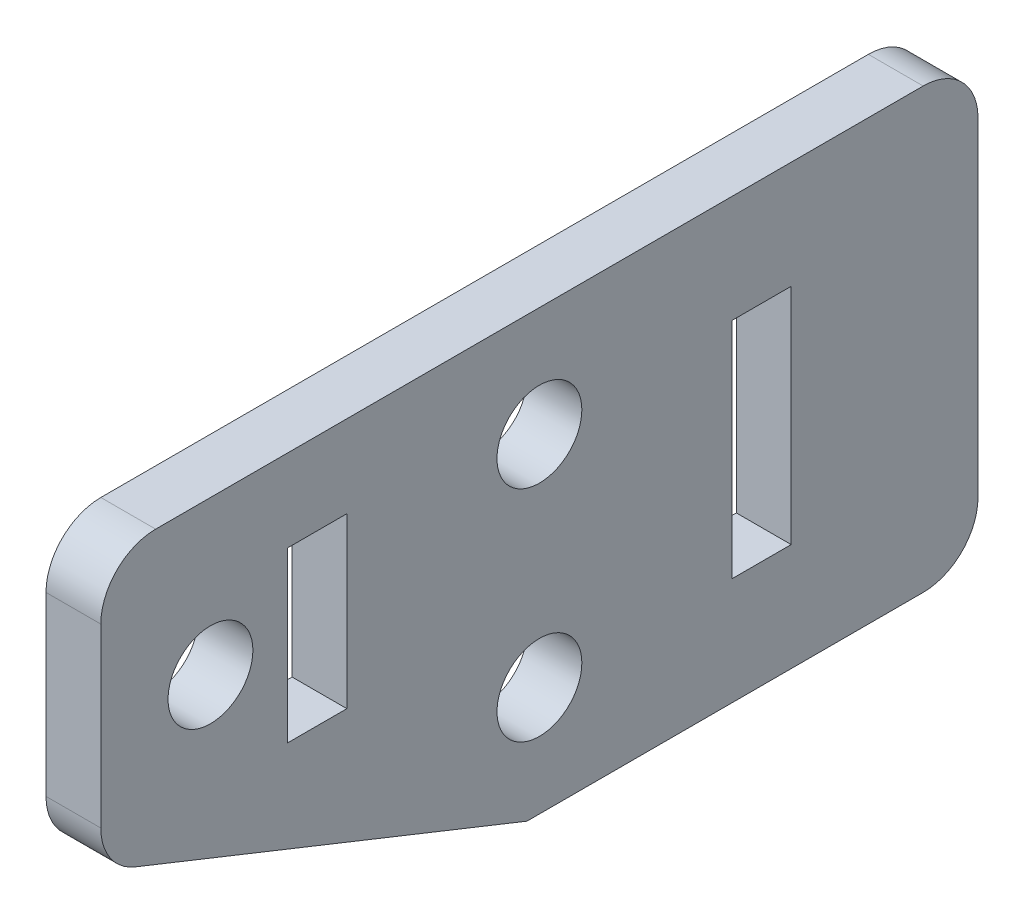
ISO-10303-21;
HEADER;
FILE_DESCRIPTION(('STEP AP214'),'2;1');
FILE_NAME('part.step','',(''),(''),'','','');
FILE_SCHEMA(('AUTOMOTIVE_DESIGN { 1 0 10303 214 1 1 1 1 }'));
ENDSEC;
DATA;
#1=APPLICATION_CONTEXT('core data for automotive mechanical design processes');
#2=APPLICATION_PROTOCOL_DEFINITION('international standard','automotive_design',2000,#1);
#3=PRODUCT_CONTEXT('',#1,'mechanical');
#4=PRODUCT('Part','Part','',(#3));
#5=PRODUCT_RELATED_PRODUCT_CATEGORY('part','',(#4));
#6=PRODUCT_DEFINITION_FORMATION('','',#4);
#7=PRODUCT_DEFINITION_CONTEXT('part definition',#1,'design');
#8=PRODUCT_DEFINITION('design','',#6,#7);
#9=PRODUCT_DEFINITION_SHAPE('','',#8);
#10=(LENGTH_UNIT() NAMED_UNIT(*) SI_UNIT(.MILLI.,.METRE.));
#11=(NAMED_UNIT(*) PLANE_ANGLE_UNIT() SI_UNIT($,.RADIAN.));
#12=(NAMED_UNIT(*) SI_UNIT($,.STERADIAN.) SOLID_ANGLE_UNIT());
#13=UNCERTAINTY_MEASURE_WITH_UNIT(LENGTH_MEASURE(1.E-05),#10,'distance_accuracy_value','');
#14=(GEOMETRIC_REPRESENTATION_CONTEXT(3) GLOBAL_UNCERTAINTY_ASSIGNED_CONTEXT((#13)) GLOBAL_UNIT_ASSIGNED_CONTEXT((#10,
#11,#12)) REPRESENTATION_CONTEXT('',''));
#15=CARTESIAN_POINT('',(0.,0.,0.));
#16=DIRECTION('',(0.,0.,1.));
#17=DIRECTION('',(1.,0.,0.));
#18=AXIS2_PLACEMENT_3D('',#15,#16,#17);
#19=CARTESIAN_POINT('',(3.175,0.,0.));
#20=DIRECTION('',(-1.,0.,0.));
#21=DIRECTION('',(0.,0.,1.));
#22=AXIS2_PLACEMENT_3D('',#19,#20,#21);
#23=PLANE('',#22);
#24=CARTESIAN_POINT('',(3.175,3.81,19.05));
#25=DIRECTION('',(1.,0.,0.));
#26=DIRECTION('',(0.,0.,-1.));
#27=AXIS2_PLACEMENT_3D('',#24,#25,#26);
#28=CIRCLE('',#27,2.45745);
#29=CARTESIAN_POINT('',(3.175,3.81,16.59255));
#30=VERTEX_POINT('',#29);
#31=EDGE_CURVE('E410',#30,#30,#28,.T.);
#32=ORIENTED_EDGE('',*,*,#31,.F.);
#33=EDGE_LOOP('',(#32));
#34=FACE_BOUND('',#33,.T.);
#35=CARTESIAN_POINT('',(3.175,-6.35,0.));
#36=DIRECTION('',(1.,0.,0.));
#37=DIRECTION('',(0.,0.,-1.));
#38=AXIS2_PLACEMENT_3D('',#35,#36,#37);
#39=CIRCLE('',#38,2.45745);
#40=CARTESIAN_POINT('',(3.175,-6.35,-2.45745));
#41=VERTEX_POINT('',#40);
#42=EDGE_CURVE('E412',#41,#41,#39,.T.);
#43=ORIENTED_EDGE('',*,*,#42,.F.);
#44=EDGE_LOOP('',(#43));
#45=FACE_BOUND('',#44,.T.);
#46=DIRECTION('',(0.,0.,-1.));
#47=VECTOR('',#46,1.);
#48=CARTESIAN_POINT('',(3.175,-1.8415,14.5796));
#49=LINE('',#48,#47);
#50=CARTESIAN_POINT('',(3.175,-1.8415,14.5796));
#51=VERTEX_POINT('',#50);
#52=CARTESIAN_POINT('',(3.175,-1.8415,11.1506));
#53=VERTEX_POINT('',#52);
#54=EDGE_CURVE('E185',#51,#53,#49,.T.);
#55=ORIENTED_EDGE('',*,*,#54,.F.);
#56=DIRECTION('',(0.,-1.,0.));
#57=VECTOR('',#56,1.);
#58=CARTESIAN_POINT('',(3.175,-1.8415,14.5796));
#59=LINE('',#58,#57);
#60=CARTESIAN_POINT('',(3.175,7.9375,14.5796));
#61=VERTEX_POINT('',#60);
#62=EDGE_CURVE('E49',#61,#51,#59,.T.);
#63=ORIENTED_EDGE('',*,*,#62,.F.);
#64=DIRECTION('',(0.,0.,1.));
#65=VECTOR('',#64,1.);
#66=CARTESIAN_POINT('',(3.175,7.9375,14.5796));
#67=LINE('',#66,#65);
#68=CARTESIAN_POINT('',(3.175,7.9375,11.1506));
#69=VERTEX_POINT('',#68);
#70=EDGE_CURVE('E173',#69,#61,#67,.T.);
#71=ORIENTED_EDGE('',*,*,#70,.F.);
#72=DIRECTION('',(0.,1.,0.));
#73=VECTOR('',#72,1.);
#74=CARTESIAN_POINT('',(3.175,-1.8415,11.1506));
#75=LINE('',#74,#73);
#76=EDGE_CURVE('E176',#53,#69,#75,.T.);
#77=ORIENTED_EDGE('',*,*,#76,.F.);
#78=EDGE_LOOP('',(#55,#63,#71,#77));
#79=FACE_BOUND('',#78,.T.);
#80=DIRECTION('',(0.,0.,-1.));
#81=VECTOR('',#80,1.);
#82=CARTESIAN_POINT('',(3.175,-6.477,-11.1506));
#83=LINE('',#82,#81);
#84=CARTESIAN_POINT('',(3.175,-6.477,-11.1506));
#85=VERTEX_POINT('',#84);
#86=CARTESIAN_POINT('',(3.175,-6.477,-14.5796));
#87=VERTEX_POINT('',#86);
#88=EDGE_CURVE('E211',#85,#87,#83,.T.);
#89=ORIENTED_EDGE('',*,*,#88,.F.);
#90=DIRECTION('',(0.,-1.,0.));
#91=VECTOR('',#90,1.);
#92=CARTESIAN_POINT('',(3.175,-6.477,-11.1506));
#93=LINE('',#92,#91);
#94=CARTESIAN_POINT('',(3.175,6.477,-11.1506));
#95=VERTEX_POINT('',#94);
#96=EDGE_CURVE('E57',#95,#85,#93,.T.);
#97=ORIENTED_EDGE('',*,*,#96,.F.);
#98=DIRECTION('',(0.,0.,1.));
#99=VECTOR('',#98,1.);
#100=CARTESIAN_POINT('',(3.175,6.477,-11.1506));
#101=LINE('',#100,#99);
#102=CARTESIAN_POINT('',(3.175,6.477,-14.5796));
#103=VERTEX_POINT('',#102);
#104=EDGE_CURVE('E200',#103,#95,#101,.T.);
#105=ORIENTED_EDGE('',*,*,#104,.F.);
#106=DIRECTION('',(0.,1.,0.));
#107=VECTOR('',#106,1.);
#108=CARTESIAN_POINT('',(3.175,-6.477,-14.5796));
#109=LINE('',#108,#107);
#110=EDGE_CURVE('E214',#87,#103,#109,.T.);
#111=ORIENTED_EDGE('',*,*,#110,.F.);
#112=EDGE_LOOP('',(#89,#97,#105,#111));
#113=FACE_BOUND('',#112,.T.);
#114=DIRECTION('',(0.,0.,-1.));
#115=VECTOR('',#114,1.);
#116=CARTESIAN_POINT('',(3.175,-12.7,25.4));
#117=LINE('',#116,#115);
#118=CARTESIAN_POINT('',(3.175,-12.7,0.719569845181661));
#119=VERTEX_POINT('',#118);
#120=CARTESIAN_POINT('',(3.175,-12.7,-22.225));
#121=VERTEX_POINT('',#120);
#122=EDGE_CURVE('E234',#119,#121,#117,.T.);
#123=ORIENTED_EDGE('',*,*,#122,.T.);
#124=CARTESIAN_POINT('',(3.175,-9.525,-22.225));
#125=DIRECTION('',(-1.,0.,0.));
#126=DIRECTION('',(0.,0.,1.));
#127=AXIS2_PLACEMENT_3D('',#124,#125,#126);
#128=CIRCLE('',#127,3.175);
#129=CARTESIAN_POINT('',(3.175,-9.525,-25.4));
#130=VERTEX_POINT('',#129);
#131=EDGE_CURVE('E277',#121,#130,#128,.F.);
#132=ORIENTED_EDGE('',*,*,#131,.T.);
#133=DIRECTION('',(0.,1.,0.));
#134=VECTOR('',#133,1.);
#135=CARTESIAN_POINT('',(3.175,-12.7,-25.4));
#136=LINE('',#135,#134);
#137=CARTESIAN_POINT('',(3.175,9.525,-25.4));
#138=VERTEX_POINT('',#137);
#139=EDGE_CURVE('E238',#130,#138,#136,.T.);
#140=ORIENTED_EDGE('',*,*,#139,.T.);
#141=CARTESIAN_POINT('',(3.175,9.525,-22.225));
#142=DIRECTION('',(-1.,0.,0.));
#143=DIRECTION('',(0.,0.,1.));
#144=AXIS2_PLACEMENT_3D('',#141,#142,#143);
#145=CIRCLE('',#144,3.175);
#146=CARTESIAN_POINT('',(3.175,12.7,-22.225));
#147=VERTEX_POINT('',#146);
#148=EDGE_CURVE('E275',#138,#147,#145,.F.);
#149=ORIENTED_EDGE('',*,*,#148,.T.);
#150=DIRECTION('',(0.,0.,1.));
#151=VECTOR('',#150,1.);
#152=CARTESIAN_POINT('',(3.175,12.7,25.4));
#153=LINE('',#152,#151);
#154=CARTESIAN_POINT('',(3.175,12.7,22.225));
#155=VERTEX_POINT('',#154);
#156=EDGE_CURVE('E241',#147,#155,#153,.T.);
#157=ORIENTED_EDGE('',*,*,#156,.T.);
#158=CARTESIAN_POINT('',(3.175,9.525,22.225));
#159=DIRECTION('',(-1.,0.,0.));
#160=DIRECTION('',(0.,0.,1.));
#161=AXIS2_PLACEMENT_3D('',#158,#159,#160);
#162=CIRCLE('',#161,3.175);
#163=CARTESIAN_POINT('',(3.175,9.525,25.4));
#164=VERTEX_POINT('',#163);
#165=EDGE_CURVE('E273',#155,#164,#162,.F.);
#166=ORIENTED_EDGE('',*,*,#165,.T.);
#167=DIRECTION('',(0.,-1.,0.));
#168=VECTOR('',#167,1.);
#169=CARTESIAN_POINT('',(3.175,-12.7,25.4));
#170=LINE('',#169,#168);
#171=CARTESIAN_POINT('',(3.175,-0.703717106092546,25.4));
#172=VERTEX_POINT('',#171);
#173=EDGE_CURVE('E231',#164,#172,#170,.T.);
#174=ORIENTED_EDGE('',*,*,#173,.T.);
#175=CARTESIAN_POINT('',(3.175,-0.703717106092546,22.225));
#176=DIRECTION('',(-1.,0.,0.));
#177=DIRECTION('',(0.,0.,1.));
#178=AXIS2_PLACEMENT_3D('',#175,#176,#177);
#179=CIRCLE('',#178,3.175);
#180=CARTESIAN_POINT('',(3.175,-3.65277101708831,23.4013103459719));
#181=VERTEX_POINT('',#180);
#182=EDGE_CURVE('E271',#172,#181,#179,.F.);
#183=ORIENTED_EDGE('',*,*,#182,.T.);
#184=DIRECTION('',(0.,0.370491447550212,0.928835877478981));
#185=VECTOR('',#184,1.);
#186=CARTESIAN_POINT('',(3.175,-4.05065103295691,22.4038103061888));
#187=LINE('',#186,#185);
#188=EDGE_CURVE('E192',#119,#181,#187,.T.);
#189=ORIENTED_EDGE('',*,*,#188,.F.);
#190=EDGE_LOOP('',(#123,#132,#140,#149,#157,#166,#174,#183,#189));
#191=FACE_BOUND('',#190,.T.);
#192=CARTESIAN_POINT('',(3.175,6.35,0.));
#193=DIRECTION('',(1.,0.,0.));
#194=DIRECTION('',(0.,0.,-1.));
#195=AXIS2_PLACEMENT_3D('',#192,#193,#194);
#196=CIRCLE('',#195,2.45745);
#197=CARTESIAN_POINT('',(3.175,6.35,-2.45745));
#198=VERTEX_POINT('',#197);
#199=EDGE_CURVE('E419',#198,#198,#196,.T.);
#200=ORIENTED_EDGE('',*,*,#199,.F.);
#201=EDGE_LOOP('',(#200));
#202=FACE_BOUND('',#201,.T.);
#203=ADVANCED_FACE('F34',(#34,#45,#79,#113,#191,#202),#23,.F.);
#204=CARTESIAN_POINT('',(0.,0.,0.));
#205=DIRECTION('',(-1.,0.,0.));
#206=DIRECTION('',(0.,0.,1.));
#207=AXIS2_PLACEMENT_3D('',#204,#205,#206);
#208=PLANE('',#207);
#209=CARTESIAN_POINT('',(0.,3.81,19.05));
#210=DIRECTION('',(1.,0.,0.));
#211=DIRECTION('',(0.,0.,-1.));
#212=AXIS2_PLACEMENT_3D('',#209,#210,#211);
#213=CIRCLE('',#212,2.45745);
#214=CARTESIAN_POINT('',(0.,3.81,16.59255));
#215=VERTEX_POINT('',#214);
#216=EDGE_CURVE('E408',#215,#215,#213,.T.);
#217=ORIENTED_EDGE('',*,*,#216,.T.);
#218=EDGE_LOOP('',(#217));
#219=FACE_BOUND('',#218,.T.);
#220=CARTESIAN_POINT('',(0.,-6.35,0.));
#221=DIRECTION('',(1.,0.,0.));
#222=DIRECTION('',(0.,0.,-1.));
#223=AXIS2_PLACEMENT_3D('',#220,#221,#222);
#224=CIRCLE('',#223,2.45745);
#225=CARTESIAN_POINT('',(0.,-6.35,-2.45745));
#226=VERTEX_POINT('',#225);
#227=EDGE_CURVE('E417',#226,#226,#224,.T.);
#228=ORIENTED_EDGE('',*,*,#227,.T.);
#229=EDGE_LOOP('',(#228));
#230=FACE_BOUND('',#229,.T.);
#231=DIRECTION('',(0.,1.,0.));
#232=VECTOR('',#231,1.);
#233=CARTESIAN_POINT('',(0.,-12.7,-25.4));
#234=LINE('',#233,#232);
#235=CARTESIAN_POINT('',(0.,-9.525,-25.4));
#236=VERTEX_POINT('',#235);
#237=CARTESIAN_POINT('',(0.,9.525,-25.4));
#238=VERTEX_POINT('',#237);
#239=EDGE_CURVE('E250',#236,#238,#234,.T.);
#240=ORIENTED_EDGE('',*,*,#239,.F.);
#241=CARTESIAN_POINT('',(0.,-9.525,-22.225));
#242=DIRECTION('',(-1.,0.,0.));
#243=DIRECTION('',(0.,0.,1.));
#244=AXIS2_PLACEMENT_3D('',#241,#242,#243);
#245=CIRCLE('',#244,3.175);
#246=CARTESIAN_POINT('',(0.,-12.7,-22.225));
#247=VERTEX_POINT('',#246);
#248=EDGE_CURVE('E267',#236,#247,#245,.T.);
#249=ORIENTED_EDGE('',*,*,#248,.T.);
#250=DIRECTION('',(0.,0.,-1.));
#251=VECTOR('',#250,1.);
#252=CARTESIAN_POINT('',(0.,-12.7,25.4));
#253=LINE('',#252,#251);
#254=CARTESIAN_POINT('',(0.,-12.7000000000009,0.719569845182034));
#255=VERTEX_POINT('',#254);
#256=EDGE_CURVE('E247',#255,#247,#253,.T.);
#257=ORIENTED_EDGE('',*,*,#256,.F.);
#258=DIRECTION('',(0.,-0.370491447550212,-0.928835877478981));
#259=VECTOR('',#258,1.);
#260=CARTESIAN_POINT('',(0.,-11.2043708203856,4.46916798196995));
#261=LINE('',#260,#259);
#262=CARTESIAN_POINT('',(0.,-3.65277101708831,23.4013103459719));
#263=VERTEX_POINT('',#262);
#264=EDGE_CURVE('E244',#263,#255,#261,.T.);
#265=ORIENTED_EDGE('',*,*,#264,.F.);
#266=CARTESIAN_POINT('',(0.,-0.703717106092546,22.225));
#267=DIRECTION('',(-1.,0.,0.));
#268=DIRECTION('',(0.,0.,1.));
#269=AXIS2_PLACEMENT_3D('',#266,#267,#268);
#270=CIRCLE('',#269,3.175);
#271=CARTESIAN_POINT('',(0.,-0.703717106092546,25.4));
#272=VERTEX_POINT('',#271);
#273=EDGE_CURVE('E261',#263,#272,#270,.T.);
#274=ORIENTED_EDGE('',*,*,#273,.T.);
#275=DIRECTION('',(0.,-1.,0.));
#276=VECTOR('',#275,1.);
#277=CARTESIAN_POINT('',(0.,-12.7,25.4));
#278=LINE('',#277,#276);
#279=CARTESIAN_POINT('',(0.,9.525,25.4));
#280=VERTEX_POINT('',#279);
#281=EDGE_CURVE('E230',#280,#272,#278,.T.);
#282=ORIENTED_EDGE('',*,*,#281,.F.);
#283=CARTESIAN_POINT('',(0.,9.525,22.225));
#284=DIRECTION('',(-1.,0.,0.));
#285=DIRECTION('',(0.,0.,1.));
#286=AXIS2_PLACEMENT_3D('',#283,#284,#285);
#287=CIRCLE('',#286,3.175);
#288=CARTESIAN_POINT('',(0.,12.7,22.225));
#289=VERTEX_POINT('',#288);
#290=EDGE_CURVE('E263',#280,#289,#287,.T.);
#291=ORIENTED_EDGE('',*,*,#290,.T.);
#292=DIRECTION('',(0.,0.,1.));
#293=VECTOR('',#292,1.);
#294=CARTESIAN_POINT('',(0.,12.7,25.4));
#295=LINE('',#294,#293);
#296=CARTESIAN_POINT('',(0.,12.7,-22.225));
#297=VERTEX_POINT('',#296);
#298=EDGE_CURVE('E235',#297,#289,#295,.T.);
#299=ORIENTED_EDGE('',*,*,#298,.F.);
#300=CARTESIAN_POINT('',(0.,9.525,-22.225));
#301=DIRECTION('',(-1.,0.,0.));
#302=DIRECTION('',(0.,0.,1.));
#303=AXIS2_PLACEMENT_3D('',#300,#301,#302);
#304=CIRCLE('',#303,3.175);
#305=EDGE_CURVE('E265',#297,#238,#304,.T.);
#306=ORIENTED_EDGE('',*,*,#305,.T.);
#307=EDGE_LOOP('',(#240,#249,#257,#265,#274,#282,#291,#299,#306));
#308=FACE_BOUND('',#307,.T.);
#309=DIRECTION('',(0.,-1.,0.));
#310=VECTOR('',#309,1.);
#311=CARTESIAN_POINT('',(0.,-6.477,-11.1506));
#312=LINE('',#311,#310);
#313=CARTESIAN_POINT('',(0.,6.477,-11.1506));
#314=VERTEX_POINT('',#313);
#315=CARTESIAN_POINT('',(0.,-6.477,-11.1506));
#316=VERTEX_POINT('',#315);
#317=EDGE_CURVE('E196',#314,#316,#312,.T.);
#318=ORIENTED_EDGE('',*,*,#317,.T.);
#319=DIRECTION('',(0.,0.,-1.));
#320=VECTOR('',#319,1.);
#321=CARTESIAN_POINT('',(0.,-6.477,-11.1506));
#322=LINE('',#321,#320);
#323=CARTESIAN_POINT('',(0.,-6.477,-14.5796));
#324=VERTEX_POINT('',#323);
#325=EDGE_CURVE('E199',#316,#324,#322,.T.);
#326=ORIENTED_EDGE('',*,*,#325,.T.);
#327=DIRECTION('',(0.,1.,0.));
#328=VECTOR('',#327,1.);
#329=CARTESIAN_POINT('',(0.,-6.477,-14.5796));
#330=LINE('',#329,#328);
#331=CARTESIAN_POINT('',(0.,6.477,-14.5796));
#332=VERTEX_POINT('',#331);
#333=EDGE_CURVE('E203',#324,#332,#330,.T.);
#334=ORIENTED_EDGE('',*,*,#333,.T.);
#335=DIRECTION('',(0.,0.,1.));
#336=VECTOR('',#335,1.);
#337=CARTESIAN_POINT('',(0.,6.477,-11.1506));
#338=LINE('',#337,#336);
#339=EDGE_CURVE('E206',#332,#314,#338,.T.);
#340=ORIENTED_EDGE('',*,*,#339,.T.);
#341=EDGE_LOOP('',(#318,#326,#334,#340));
#342=FACE_BOUND('',#341,.T.);
#343=DIRECTION('',(0.,-1.,0.));
#344=VECTOR('',#343,1.);
#345=CARTESIAN_POINT('',(0.,-1.8415,14.5796));
#346=LINE('',#345,#344);
#347=CARTESIAN_POINT('',(0.,7.9375,14.5796));
#348=VERTEX_POINT('',#347);
#349=CARTESIAN_POINT('',(0.,-1.8415,14.5796));
#350=VERTEX_POINT('',#349);
#351=EDGE_CURVE('E154',#348,#350,#346,.T.);
#352=ORIENTED_EDGE('',*,*,#351,.T.);
#353=DIRECTION('',(0.,0.,-1.));
#354=VECTOR('',#353,1.);
#355=CARTESIAN_POINT('',(0.,-1.8415,14.5796));
#356=LINE('',#355,#354);
#357=CARTESIAN_POINT('',(0.,-1.8415,11.1506));
#358=VERTEX_POINT('',#357);
#359=EDGE_CURVE('E164',#350,#358,#356,.T.);
#360=ORIENTED_EDGE('',*,*,#359,.T.);
#361=DIRECTION('',(0.,1.,0.));
#362=VECTOR('',#361,1.);
#363=CARTESIAN_POINT('',(0.,-1.8415,11.1506));
#364=LINE('',#363,#362);
#365=CARTESIAN_POINT('',(0.,7.9375,11.1506));
#366=VERTEX_POINT('',#365);
#367=EDGE_CURVE('E168',#358,#366,#364,.T.);
#368=ORIENTED_EDGE('',*,*,#367,.T.);
#369=DIRECTION('',(0.,0.,1.));
#370=VECTOR('',#369,1.);
#371=CARTESIAN_POINT('',(0.,7.9375,14.5796));
#372=LINE('',#371,#370);
#373=EDGE_CURVE('E160',#366,#348,#372,.T.);
#374=ORIENTED_EDGE('',*,*,#373,.T.);
#375=EDGE_LOOP('',(#352,#360,#368,#374));
#376=FACE_BOUND('',#375,.T.);
#377=CARTESIAN_POINT('',(0.,6.35,0.));
#378=DIRECTION('',(1.,0.,0.));
#379=DIRECTION('',(0.,0.,-1.));
#380=AXIS2_PLACEMENT_3D('',#377,#378,#379);
#381=CIRCLE('',#380,2.45745);
#382=CARTESIAN_POINT('',(0.,6.35,-2.45745));
#383=VERTEX_POINT('',#382);
#384=EDGE_CURVE('E179',#383,#383,#381,.T.);
#385=ORIENTED_EDGE('',*,*,#384,.T.);
#386=EDGE_LOOP('',(#385));
#387=FACE_BOUND('',#386,.T.);
#388=ADVANCED_FACE('F170',(#219,#230,#308,#342,#376,#387),#208,.T.);
#389=CARTESIAN_POINT('',(3.175,-12.7,25.4));
#390=DIRECTION('',(0.,0.,-1.));
#391=DIRECTION('',(-1.,0.,0.));
#392=AXIS2_PLACEMENT_3D('',#389,#390,#391);
#393=PLANE('',#392);
#394=ORIENTED_EDGE('',*,*,#173,.F.);
#395=DIRECTION('',(-1.,0.,0.));
#396=VECTOR('',#395,1.);
#397=CARTESIAN_POINT('',(3.175,9.525,25.4));
#398=LINE('',#397,#396);
#399=EDGE_CURVE('E42',#164,#280,#398,.T.);
#400=ORIENTED_EDGE('',*,*,#399,.T.);
#401=ORIENTED_EDGE('',*,*,#281,.T.);
#402=DIRECTION('',(1.,0.,0.));
#403=VECTOR('',#402,1.);
#404=CARTESIAN_POINT('',(3.175,-0.703717106092546,25.4));
#405=LINE('',#404,#403);
#406=EDGE_CURVE('E284',#272,#172,#405,.T.);
#407=ORIENTED_EDGE('',*,*,#406,.T.);
#408=EDGE_LOOP('',(#394,#400,#401,#407));
#409=FACE_BOUND('',#408,.T.);
#410=ADVANCED_FACE('F291',(#409),#393,.F.);
#411=CARTESIAN_POINT('',(3.175,-12.7,25.4));
#412=DIRECTION('',(0.,1.,0.));
#413=DIRECTION('',(0.,0.,1.));
#414=AXIS2_PLACEMENT_3D('',#411,#412,#413);
#415=PLANE('',#414);
#416=ORIENTED_EDGE('',*,*,#256,.T.);
#417=DIRECTION('',(-1.,0.,0.));
#418=VECTOR('',#417,1.);
#419=CARTESIAN_POINT('',(3.175,-12.7,-22.225));
#420=LINE('',#419,#418);
#421=EDGE_CURVE('E269',#247,#121,#420,.F.);
#422=ORIENTED_EDGE('',*,*,#421,.T.);
#423=ORIENTED_EDGE('',*,*,#122,.F.);
#424=DIRECTION('',(-1.,0.,0.));
#425=VECTOR('',#424,1.);
#426=CARTESIAN_POINT('',(3.175,-12.7,0.719569845181667));
#427=LINE('',#426,#425);
#428=EDGE_CURVE('E227',#119,#255,#427,.T.);
#429=ORIENTED_EDGE('',*,*,#428,.T.);
#430=EDGE_LOOP('',(#416,#422,#423,#429));
#431=FACE_BOUND('',#430,.T.);
#432=ADVANCED_FACE('F326',(#431),#415,.F.);
#433=CARTESIAN_POINT('',(3.175,-12.7,-25.4));
#434=DIRECTION('',(0.,0.,1.));
#435=DIRECTION('',(1.,0.,0.));
#436=AXIS2_PLACEMENT_3D('',#433,#434,#435);
#437=PLANE('',#436);
#438=ORIENTED_EDGE('',*,*,#139,.F.);
#439=DIRECTION('',(-1.,0.,0.));
#440=VECTOR('',#439,1.);
#441=CARTESIAN_POINT('',(3.175,-9.525,-25.4));
#442=LINE('',#441,#440);
#443=EDGE_CURVE('E258',#130,#236,#442,.T.);
#444=ORIENTED_EDGE('',*,*,#443,.T.);
#445=ORIENTED_EDGE('',*,*,#239,.T.);
#446=DIRECTION('',(-1.,0.,0.));
#447=VECTOR('',#446,1.);
#448=CARTESIAN_POINT('',(3.175,9.525,-25.4));
#449=LINE('',#448,#447);
#450=EDGE_CURVE('E256',#238,#138,#449,.F.);
#451=ORIENTED_EDGE('',*,*,#450,.T.);
#452=EDGE_LOOP('',(#438,#444,#445,#451));
#453=FACE_BOUND('',#452,.T.);
#454=ADVANCED_FACE('F317',(#453),#437,.F.);
#455=CARTESIAN_POINT('',(3.175,12.7,25.4));
#456=DIRECTION('',(0.,-1.,0.));
#457=DIRECTION('',(0.,0.,-1.));
#458=AXIS2_PLACEMENT_3D('',#455,#456,#457);
#459=PLANE('',#458);
#460=ORIENTED_EDGE('',*,*,#156,.F.);
#461=DIRECTION('',(-1.,0.,0.));
#462=VECTOR('',#461,1.);
#463=CARTESIAN_POINT('',(3.175,12.7,-22.225));
#464=LINE('',#463,#462);
#465=EDGE_CURVE('E281',#147,#297,#464,.T.);
#466=ORIENTED_EDGE('',*,*,#465,.T.);
#467=ORIENTED_EDGE('',*,*,#298,.T.);
#468=DIRECTION('',(-1.,0.,0.));
#469=VECTOR('',#468,1.);
#470=CARTESIAN_POINT('',(3.175,12.7,22.225));
#471=LINE('',#470,#469);
#472=EDGE_CURVE('E279',#289,#155,#471,.F.);
#473=ORIENTED_EDGE('',*,*,#472,.T.);
#474=EDGE_LOOP('',(#460,#466,#467,#473));
#475=FACE_BOUND('',#474,.T.);
#476=ADVANCED_FACE('F311',(#475),#459,.F.);
#477=CARTESIAN_POINT('',(0.,-4.05065103295691,22.4038103061888));
#478=DIRECTION('',(0.,0.928835877478981,-0.370491447550212));
#479=DIRECTION('',(0.,0.370491447550212,0.928835877478981));
#480=AXIS2_PLACEMENT_3D('',#477,#478,#479);
#481=PLANE('',#480);
#482=ORIENTED_EDGE('',*,*,#188,.T.);
#483=DIRECTION('',(1.,0.,0.));
#484=VECTOR('',#483,1.);
#485=CARTESIAN_POINT('',(0.,-3.65277101708831,23.4013103459719));
#486=LINE('',#485,#484);
#487=EDGE_CURVE('E11',#181,#263,#486,.F.);
#488=ORIENTED_EDGE('',*,*,#487,.T.);
#489=ORIENTED_EDGE('',*,*,#264,.T.);
#490=ORIENTED_EDGE('',*,*,#428,.F.);
#491=EDGE_LOOP('',(#482,#488,#489,#490));
#492=FACE_BOUND('',#491,.T.);
#493=ADVANCED_FACE('F329',(#492),#481,.F.);
#494=CARTESIAN_POINT('',(3.175,-9.525,-22.225));
#495=DIRECTION('',(-1.,0.,0.));
#496=DIRECTION('',(0.,0.,1.));
#497=AXIS2_PLACEMENT_3D('',#494,#495,#496);
#498=CYLINDRICAL_SURFACE('',#497,3.175);
#499=ORIENTED_EDGE('',*,*,#131,.F.);
#500=ORIENTED_EDGE('',*,*,#421,.F.);
#501=ORIENTED_EDGE('',*,*,#248,.F.);
#502=ORIENTED_EDGE('',*,*,#443,.F.);
#503=EDGE_LOOP('',(#499,#500,#501,#502));
#504=FACE_BOUND('',#503,.T.);
#505=ADVANCED_FACE('F323',(#504),#498,.T.);
#506=CARTESIAN_POINT('',(3.175,9.525,-22.225));
#507=DIRECTION('',(-1.,0.,0.));
#508=DIRECTION('',(0.,0.,1.));
#509=AXIS2_PLACEMENT_3D('',#506,#507,#508);
#510=CYLINDRICAL_SURFACE('',#509,3.175);
#511=ORIENTED_EDGE('',*,*,#148,.F.);
#512=ORIENTED_EDGE('',*,*,#450,.F.);
#513=ORIENTED_EDGE('',*,*,#305,.F.);
#514=ORIENTED_EDGE('',*,*,#465,.F.);
#515=EDGE_LOOP('',(#511,#512,#513,#514));
#516=FACE_BOUND('',#515,.T.);
#517=ADVANCED_FACE('F320',(#516),#510,.T.);
#518=CARTESIAN_POINT('',(3.175,9.525,22.225));
#519=DIRECTION('',(-1.,0.,0.));
#520=DIRECTION('',(0.,0.,1.));
#521=AXIS2_PLACEMENT_3D('',#518,#519,#520);
#522=CYLINDRICAL_SURFACE('',#521,3.175);
#523=ORIENTED_EDGE('',*,*,#165,.F.);
#524=ORIENTED_EDGE('',*,*,#472,.F.);
#525=ORIENTED_EDGE('',*,*,#290,.F.);
#526=ORIENTED_EDGE('',*,*,#399,.F.);
#527=EDGE_LOOP('',(#523,#524,#525,#526));
#528=FACE_BOUND('',#527,.T.);
#529=ADVANCED_FACE('F309',(#528),#522,.T.);
#530=CARTESIAN_POINT('',(3.175,-0.703717106092546,22.225));
#531=DIRECTION('',(1.,0.,0.));
#532=DIRECTION('',(0.,0.,-1.));
#533=AXIS2_PLACEMENT_3D('',#530,#531,#532);
#534=CYLINDRICAL_SURFACE('',#533,3.175);
#535=ORIENTED_EDGE('',*,*,#273,.F.);
#536=ORIENTED_EDGE('',*,*,#487,.F.);
#537=ORIENTED_EDGE('',*,*,#182,.F.);
#538=ORIENTED_EDGE('',*,*,#406,.F.);
#539=EDGE_LOOP('',(#535,#536,#537,#538));
#540=FACE_BOUND('',#539,.T.);
#541=ADVANCED_FACE('F36',(#540),#534,.T.);
#542=CARTESIAN_POINT('',(0.,-6.477,-11.1506));
#543=DIRECTION('',(0.,0.,1.));
#544=DIRECTION('',(0.,-1.,0.));
#545=AXIS2_PLACEMENT_3D('',#542,#543,#544);
#546=PLANE('',#545);
#547=ORIENTED_EDGE('',*,*,#96,.T.);
#548=DIRECTION('',(1.,0.,0.));
#549=VECTOR('',#548,1.);
#550=CARTESIAN_POINT('',(0.,-6.477,-11.1506));
#551=LINE('',#550,#549);
#552=EDGE_CURVE('E209',#316,#85,#551,.T.);
#553=ORIENTED_EDGE('',*,*,#552,.F.);
#554=ORIENTED_EDGE('',*,*,#317,.F.);
#555=DIRECTION('',(1.,0.,0.));
#556=VECTOR('',#555,1.);
#557=CARTESIAN_POINT('',(0.,6.477,-11.1506));
#558=LINE('',#557,#556);
#559=EDGE_CURVE('E186',#314,#95,#558,.T.);
#560=ORIENTED_EDGE('',*,*,#559,.T.);
#561=EDGE_LOOP('',(#547,#553,#554,#560));
#562=FACE_BOUND('',#561,.T.);
#563=ADVANCED_FACE('F361',(#562),#546,.F.);
#564=CARTESIAN_POINT('',(0.,6.477,-11.1506));
#565=DIRECTION('',(0.,1.,0.));
#566=DIRECTION('',(0.,0.,1.));
#567=AXIS2_PLACEMENT_3D('',#564,#565,#566);
#568=PLANE('',#567);
#569=ORIENTED_EDGE('',*,*,#104,.T.);
#570=ORIENTED_EDGE('',*,*,#559,.F.);
#571=ORIENTED_EDGE('',*,*,#339,.F.);
#572=DIRECTION('',(1.,0.,0.));
#573=VECTOR('',#572,1.);
#574=CARTESIAN_POINT('',(0.,6.477,-14.5796));
#575=LINE('',#574,#573);
#576=EDGE_CURVE('E220',#332,#103,#575,.T.);
#577=ORIENTED_EDGE('',*,*,#576,.T.);
#578=EDGE_LOOP('',(#569,#570,#571,#577));
#579=FACE_BOUND('',#578,.T.);
#580=ADVANCED_FACE('F365',(#579),#568,.F.);
#581=CARTESIAN_POINT('',(0.,-6.477,-14.5796));
#582=DIRECTION('',(0.,0.,-1.));
#583=DIRECTION('',(0.,1.,0.));
#584=AXIS2_PLACEMENT_3D('',#581,#582,#583);
#585=PLANE('',#584);
#586=ORIENTED_EDGE('',*,*,#110,.T.);
#587=ORIENTED_EDGE('',*,*,#576,.F.);
#588=ORIENTED_EDGE('',*,*,#333,.F.);
#589=DIRECTION('',(1.,0.,0.));
#590=VECTOR('',#589,1.);
#591=CARTESIAN_POINT('',(0.,-6.477,-14.5796));
#592=LINE('',#591,#590);
#593=EDGE_CURVE('E222',#324,#87,#592,.T.);
#594=ORIENTED_EDGE('',*,*,#593,.T.);
#595=EDGE_LOOP('',(#586,#587,#588,#594));
#596=FACE_BOUND('',#595,.T.);
#597=ADVANCED_FACE('F369',(#596),#585,.F.);
#598=CARTESIAN_POINT('',(0.,-6.477,-11.1506));
#599=DIRECTION('',(0.,-1.,0.));
#600=DIRECTION('',(0.,0.,-1.));
#601=AXIS2_PLACEMENT_3D('',#598,#599,#600);
#602=PLANE('',#601);
#603=ORIENTED_EDGE('',*,*,#88,.T.);
#604=ORIENTED_EDGE('',*,*,#593,.F.);
#605=ORIENTED_EDGE('',*,*,#325,.F.);
#606=ORIENTED_EDGE('',*,*,#552,.T.);
#607=EDGE_LOOP('',(#603,#604,#605,#606));
#608=FACE_BOUND('',#607,.T.);
#609=ADVANCED_FACE('F373',(#608),#602,.F.);
#610=CARTESIAN_POINT('',(0.,-1.8415,14.5796));
#611=DIRECTION('',(0.,0.,1.));
#612=DIRECTION('',(1.,0.,0.));
#613=AXIS2_PLACEMENT_3D('',#610,#611,#612);
#614=PLANE('',#613);
#615=ORIENTED_EDGE('',*,*,#62,.T.);
#616=DIRECTION('',(1.,0.,0.));
#617=VECTOR('',#616,1.);
#618=CARTESIAN_POINT('',(0.,-1.8415,14.5796));
#619=LINE('',#618,#617);
#620=EDGE_CURVE('E150',#350,#51,#619,.T.);
#621=ORIENTED_EDGE('',*,*,#620,.F.);
#622=ORIENTED_EDGE('',*,*,#351,.F.);
#623=DIRECTION('',(1.,0.,0.));
#624=VECTOR('',#623,1.);
#625=CARTESIAN_POINT('',(0.,7.9375,14.5796));
#626=LINE('',#625,#624);
#627=EDGE_CURVE('E190',#348,#61,#626,.T.);
#628=ORIENTED_EDGE('',*,*,#627,.T.);
#629=EDGE_LOOP('',(#615,#621,#622,#628));
#630=FACE_BOUND('',#629,.T.);
#631=ADVANCED_FACE('F152',(#630),#614,.F.);
#632=CARTESIAN_POINT('',(0.,7.9375,14.5796));
#633=DIRECTION('',(0.,1.,0.));
#634=DIRECTION('',(0.,0.,1.));
#635=AXIS2_PLACEMENT_3D('',#632,#633,#634);
#636=PLANE('',#635);
#637=ORIENTED_EDGE('',*,*,#70,.T.);
#638=ORIENTED_EDGE('',*,*,#627,.F.);
#639=ORIENTED_EDGE('',*,*,#373,.F.);
#640=DIRECTION('',(1.,0.,0.));
#641=VECTOR('',#640,1.);
#642=CARTESIAN_POINT('',(0.,7.9375,11.1506));
#643=LINE('',#642,#641);
#644=EDGE_CURVE('E193',#366,#69,#643,.T.);
#645=ORIENTED_EDGE('',*,*,#644,.T.);
#646=EDGE_LOOP('',(#637,#638,#639,#645));
#647=FACE_BOUND('',#646,.T.);
#648=ADVANCED_FACE('F382',(#647),#636,.F.);
#649=CARTESIAN_POINT('',(0.,-1.8415,11.1506));
#650=DIRECTION('',(0.,0.,-1.));
#651=DIRECTION('',(0.,1.,0.));
#652=AXIS2_PLACEMENT_3D('',#649,#650,#651);
#653=PLANE('',#652);
#654=ORIENTED_EDGE('',*,*,#76,.T.);
#655=ORIENTED_EDGE('',*,*,#644,.F.);
#656=ORIENTED_EDGE('',*,*,#367,.F.);
#657=DIRECTION('',(1.,0.,0.));
#658=VECTOR('',#657,1.);
#659=CARTESIAN_POINT('',(0.,-1.8415,11.1506));
#660=LINE('',#659,#658);
#661=EDGE_CURVE('E159',#358,#53,#660,.T.);
#662=ORIENTED_EDGE('',*,*,#661,.T.);
#663=EDGE_LOOP('',(#654,#655,#656,#662));
#664=FACE_BOUND('',#663,.T.);
#665=ADVANCED_FACE('F386',(#664),#653,.F.);
#666=CARTESIAN_POINT('',(0.,-1.8415,14.5796));
#667=DIRECTION('',(0.,-1.,0.));
#668=DIRECTION('',(0.,0.,-1.));
#669=AXIS2_PLACEMENT_3D('',#666,#667,#668);
#670=PLANE('',#669);
#671=ORIENTED_EDGE('',*,*,#54,.T.);
#672=ORIENTED_EDGE('',*,*,#661,.F.);
#673=ORIENTED_EDGE('',*,*,#359,.F.);
#674=ORIENTED_EDGE('',*,*,#620,.T.);
#675=EDGE_LOOP('',(#671,#672,#673,#674));
#676=FACE_BOUND('',#675,.T.);
#677=ADVANCED_FACE('F165',(#676),#670,.F.);
#678=CARTESIAN_POINT('',(3.175,6.35,0.));
#679=DIRECTION('',(1.,0.,0.));
#680=DIRECTION('',(0.,0.,-1.));
#681=AXIS2_PLACEMENT_3D('',#678,#679,#680);
#682=CYLINDRICAL_SURFACE('',#681,2.45745);
#683=ORIENTED_EDGE('',*,*,#384,.F.);
#684=EDGE_LOOP('',(#683));
#685=FACE_BOUND('',#684,.T.);
#686=ORIENTED_EDGE('',*,*,#199,.T.);
#687=EDGE_LOOP('',(#686));
#688=FACE_BOUND('',#687,.T.);
#689=ADVANCED_FACE('F385',(#685,#688),#682,.F.);
#690=CARTESIAN_POINT('',(3.175,-6.35,0.));
#691=DIRECTION('',(1.,0.,0.));
#692=DIRECTION('',(0.,0.,-1.));
#693=AXIS2_PLACEMENT_3D('',#690,#691,#692);
#694=CYLINDRICAL_SURFACE('',#693,2.45745);
#695=ORIENTED_EDGE('',*,*,#227,.F.);
#696=EDGE_LOOP('',(#695));
#697=FACE_BOUND('',#696,.T.);
#698=ORIENTED_EDGE('',*,*,#42,.T.);
#699=EDGE_LOOP('',(#698));
#700=FACE_BOUND('',#699,.T.);
#701=ADVANCED_FACE('F395',(#697,#700),#694,.F.);
#702=CARTESIAN_POINT('',(3.175,3.81,19.05));
#703=DIRECTION('',(1.,0.,0.));
#704=DIRECTION('',(0.,0.,-1.));
#705=AXIS2_PLACEMENT_3D('',#702,#703,#704);
#706=CYLINDRICAL_SURFACE('',#705,2.45745);
#707=ORIENTED_EDGE('',*,*,#216,.F.);
#708=EDGE_LOOP('',(#707));
#709=FACE_BOUND('',#708,.T.);
#710=ORIENTED_EDGE('',*,*,#31,.T.);
#711=EDGE_LOOP('',(#710));
#712=FACE_BOUND('',#711,.T.);
#713=ADVANCED_FACE('F399',(#709,#712),#706,.F.);
#714=CLOSED_SHELL('',(#203,#388,#410,#432,#454,#476,#493,#505,#517,#529,#541,#563,#580,#597,
#609,#631,#648,#665,#677,#689,#701,#713));
#715=MANIFOLD_SOLID_BREP('B2',#714);
#716=ADVANCED_BREP_SHAPE_REPRESENTATION('',(#18,#715),#14);
#717=SHAPE_DEFINITION_REPRESENTATION(#9,#716);
ENDSEC;
END-ISO-10303-21;
